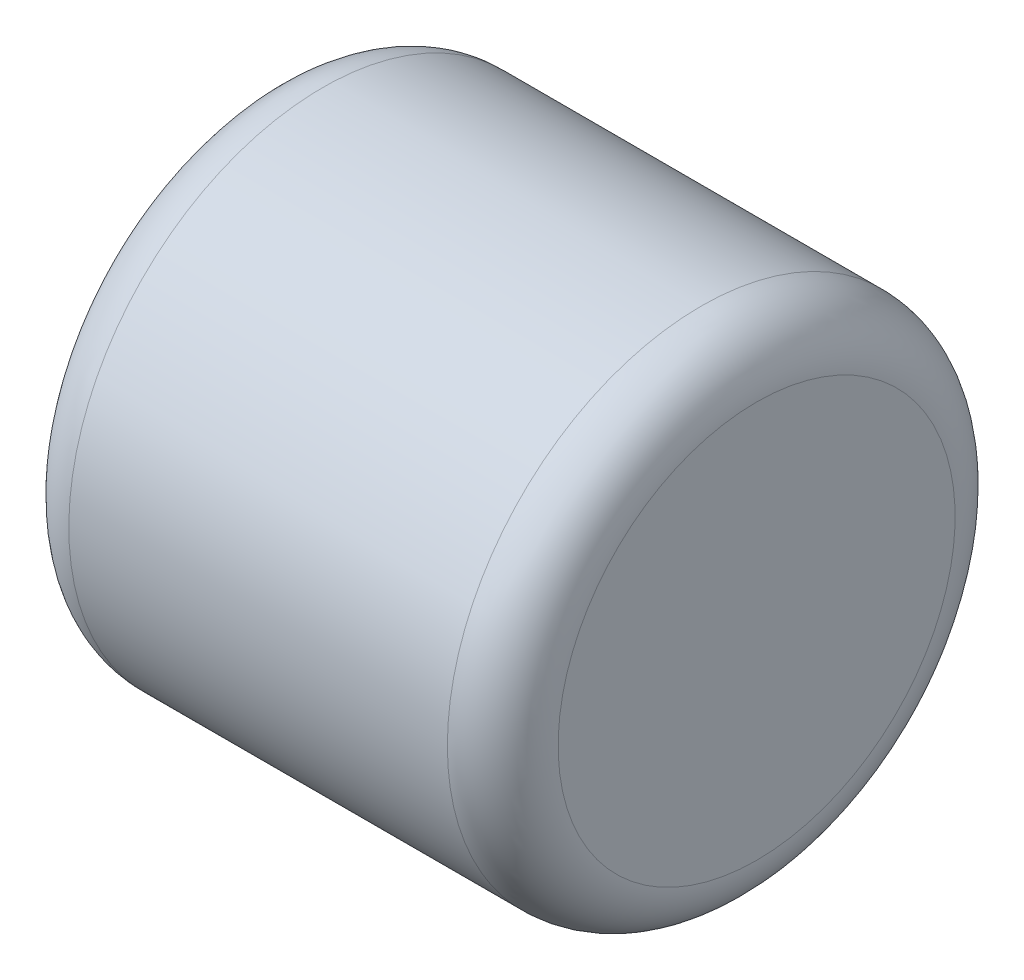
ISO-10303-21;
HEADER;
FILE_DESCRIPTION(('STEP AP214'),'2;1');
FILE_NAME('part.step','',(''),(''),'','','');
FILE_SCHEMA(('AUTOMOTIVE_DESIGN { 1 0 10303 214 1 1 1 1 }'));
ENDSEC;
DATA;
#1=APPLICATION_CONTEXT('core data for automotive mechanical design processes');
#2=APPLICATION_PROTOCOL_DEFINITION('international standard','automotive_design',2000,#1);
#3=PRODUCT_CONTEXT('',#1,'mechanical');
#4=PRODUCT('Part','Part','',(#3));
#5=PRODUCT_RELATED_PRODUCT_CATEGORY('part','',(#4));
#6=PRODUCT_DEFINITION_FORMATION('','',#4);
#7=PRODUCT_DEFINITION_CONTEXT('part definition',#1,'design');
#8=PRODUCT_DEFINITION('design','',#6,#7);
#9=PRODUCT_DEFINITION_SHAPE('','',#8);
#10=(LENGTH_UNIT() NAMED_UNIT(*) SI_UNIT(.MILLI.,.METRE.));
#11=(NAMED_UNIT(*) PLANE_ANGLE_UNIT() SI_UNIT($,.RADIAN.));
#12=(NAMED_UNIT(*) SI_UNIT($,.STERADIAN.) SOLID_ANGLE_UNIT());
#13=UNCERTAINTY_MEASURE_WITH_UNIT(LENGTH_MEASURE(1.E-05),#10,'distance_accuracy_value','');
#14=(GEOMETRIC_REPRESENTATION_CONTEXT(3) GLOBAL_UNCERTAINTY_ASSIGNED_CONTEXT((#13)) GLOBAL_UNIT_ASSIGNED_CONTEXT((#10,
#11,#12)) REPRESENTATION_CONTEXT('',''));
#15=CARTESIAN_POINT('',(0.,0.,0.));
#16=DIRECTION('',(0.,0.,1.));
#17=DIRECTION('',(1.,0.,0.));
#18=AXIS2_PLACEMENT_3D('',#15,#16,#17);
#19=CARTESIAN_POINT('',(2.85,1.075,12.4));
#20=DIRECTION('',(-1.,0.,0.));
#21=DIRECTION('',(0.,-1.,0.));
#22=AXIS2_PLACEMENT_3D('',#19,#20,#21);
#23=PLANE('',#22);
#24=CARTESIAN_POINT('',(2.85,0.,12.4));
#25=DIRECTION('',(1.,0.,0.));
#26=DIRECTION('',(0.,1.,0.));
#27=AXIS2_PLACEMENT_3D('',#24,#25,#26);
#28=CIRCLE('',#27,2.15);
#29=CARTESIAN_POINT('',(2.85,2.15,12.4));
#30=VERTEX_POINT('',#29);
#31=EDGE_CURVE('E61',#30,#30,#28,.T.);
#32=ORIENTED_EDGE('',*,*,#31,.F.);
#33=EDGE_LOOP('',(#32));
#34=FACE_BOUND('',#33,.T.);
#35=ADVANCED_FACE('F14',(#34),#23,.T.);
#36=CARTESIAN_POINT('',(8.15,1.075,12.4));
#37=DIRECTION('',(1.,0.,0.));
#38=DIRECTION('',(0.,0.,-1.));
#39=AXIS2_PLACEMENT_3D('',#36,#37,#38);
#40=PLANE('',#39);
#41=CARTESIAN_POINT('',(8.15,0.,12.4));
#42=DIRECTION('',(-1.,0.,0.));
#43=DIRECTION('',(0.,1.,0.));
#44=AXIS2_PLACEMENT_3D('',#41,#42,#43);
#45=CIRCLE('',#44,2.15);
#46=CARTESIAN_POINT('',(8.15,2.15,12.4));
#47=VERTEX_POINT('',#46);
#48=EDGE_CURVE('E29',#47,#47,#45,.T.);
#49=ORIENTED_EDGE('',*,*,#48,.F.);
#50=EDGE_LOOP('',(#49));
#51=FACE_BOUND('',#50,.T.);
#52=ADVANCED_FACE('F73',(#51),#40,.T.);
#53=CARTESIAN_POINT('',(3.45,0.,12.4));
#54=DIRECTION('',(-1.,0.,0.));
#55=DIRECTION('',(0.,0.,1.));
#56=AXIS2_PLACEMENT_3D('',#53,#54,#55);
#57=TOROIDAL_SURFACE('',#56,2.15,0.6);
#58=CARTESIAN_POINT('',(3.45,0.,12.4));
#59=DIRECTION('',(-1.,0.,0.));
#60=DIRECTION('',(0.,-1.,0.));
#61=AXIS2_PLACEMENT_3D('',#58,#59,#60);
#62=CIRCLE('',#61,2.75);
#63=CARTESIAN_POINT('',(3.45,-2.75,12.4));
#64=VERTEX_POINT('',#63);
#65=EDGE_CURVE('E24',#64,#64,#62,.F.);
#66=ORIENTED_EDGE('',*,*,#65,.F.);
#67=EDGE_LOOP('',(#66));
#68=FACE_BOUND('',#67,.T.);
#69=ORIENTED_EDGE('',*,*,#31,.T.);
#70=EDGE_LOOP('',(#69));
#71=FACE_BOUND('',#70,.T.);
#72=ADVANCED_FACE('F42',(#68,#71),#57,.T.);
#73=CARTESIAN_POINT('',(7.55,0.,12.4));
#74=DIRECTION('',(-1.,0.,0.));
#75=DIRECTION('',(0.,0.,1.));
#76=AXIS2_PLACEMENT_3D('',#73,#74,#75);
#77=TOROIDAL_SURFACE('',#76,2.15,0.600000000000001);
#78=ORIENTED_EDGE('',*,*,#48,.T.);
#79=EDGE_LOOP('',(#78));
#80=FACE_BOUND('',#79,.T.);
#81=CARTESIAN_POINT('',(7.55,0.,12.4));
#82=DIRECTION('',(-1.,0.,0.));
#83=DIRECTION('',(0.,-1.,0.));
#84=AXIS2_PLACEMENT_3D('',#81,#82,#83);
#85=CIRCLE('',#84,2.75);
#86=CARTESIAN_POINT('',(7.55,-2.75,12.4));
#87=VERTEX_POINT('',#86);
#88=EDGE_CURVE('E10',#87,#87,#85,.T.);
#89=ORIENTED_EDGE('',*,*,#88,.F.);
#90=EDGE_LOOP('',(#89));
#91=FACE_BOUND('',#90,.T.);
#92=ADVANCED_FACE('F37',(#80,#91),#77,.T.);
#93=CARTESIAN_POINT('',(5.5,0.,12.4));
#94=DIRECTION('',(-1.,0.,0.));
#95=DIRECTION('',(0.,-1.,0.));
#96=AXIS2_PLACEMENT_3D('',#93,#94,#95);
#97=CYLINDRICAL_SURFACE('',#96,2.75);
#98=ORIENTED_EDGE('',*,*,#65,.T.);
#99=EDGE_LOOP('',(#98));
#100=FACE_BOUND('',#99,.T.);
#101=ORIENTED_EDGE('',*,*,#88,.T.);
#102=EDGE_LOOP('',(#101));
#103=FACE_BOUND('',#102,.T.);
#104=ADVANCED_FACE('F41',(#100,#103),#97,.T.);
#105=CLOSED_SHELL('',(#35,#52,#72,#92,#104));
#106=MANIFOLD_SOLID_BREP('B1',#105);
#107=ADVANCED_BREP_SHAPE_REPRESENTATION('',(#18,#106),#14);
#108=SHAPE_DEFINITION_REPRESENTATION(#9,#107);
ENDSEC;
END-ISO-10303-21;
